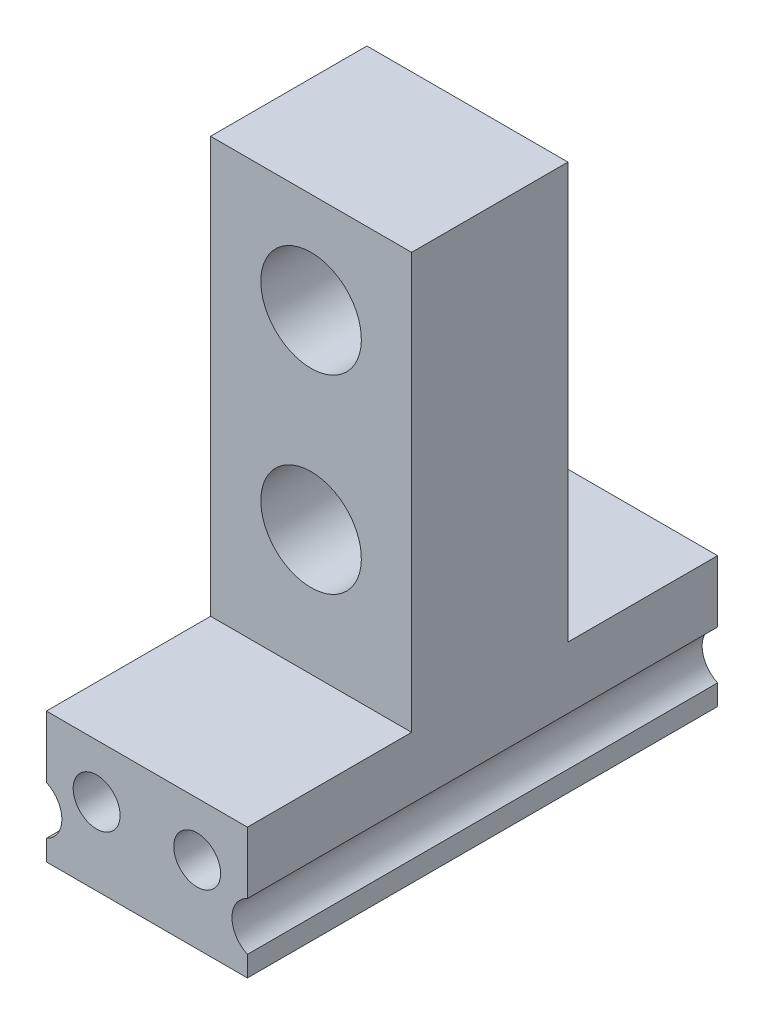
ISO-10303-21;
HEADER;
FILE_DESCRIPTION(('STEP AP214'),'2;1');
FILE_NAME('part.step','',(''),(''),'','','');
FILE_SCHEMA(('AUTOMOTIVE_DESIGN { 1 0 10303 214 1 1 1 1 }'));
ENDSEC;
DATA;
#1=APPLICATION_CONTEXT('core data for automotive mechanical design processes');
#2=APPLICATION_PROTOCOL_DEFINITION('international standard','automotive_design',2000,#1);
#3=PRODUCT_CONTEXT('',#1,'mechanical');
#4=PRODUCT('Part','Part','',(#3));
#5=PRODUCT_RELATED_PRODUCT_CATEGORY('part','',(#4));
#6=PRODUCT_DEFINITION_FORMATION('','',#4);
#7=PRODUCT_DEFINITION_CONTEXT('part definition',#1,'design');
#8=PRODUCT_DEFINITION('design','',#6,#7);
#9=PRODUCT_DEFINITION_SHAPE('','',#8);
#10=(LENGTH_UNIT() NAMED_UNIT(*) SI_UNIT(.MILLI.,.METRE.));
#11=(NAMED_UNIT(*) PLANE_ANGLE_UNIT() SI_UNIT($,.RADIAN.));
#12=(NAMED_UNIT(*) SI_UNIT($,.STERADIAN.) SOLID_ANGLE_UNIT());
#13=UNCERTAINTY_MEASURE_WITH_UNIT(LENGTH_MEASURE(1.E-05),#10,'distance_accuracy_value','');
#14=(GEOMETRIC_REPRESENTATION_CONTEXT(3) GLOBAL_UNCERTAINTY_ASSIGNED_CONTEXT((#13)) GLOBAL_UNIT_ASSIGNED_CONTEXT((#10,
#11,#12)) REPRESENTATION_CONTEXT('',''));
#15=CARTESIAN_POINT('',(0.,0.,0.));
#16=DIRECTION('',(0.,0.,1.));
#17=DIRECTION('',(1.,0.,0.));
#18=AXIS2_PLACEMENT_3D('',#15,#16,#17);
#19=CARTESIAN_POINT('',(415.099665512143,0.,42.1));
#20=DIRECTION('',(1.,0.,0.));
#21=DIRECTION('',(0.,0.,-1.));
#22=AXIS2_PLACEMENT_3D('',#19,#20,#21);
#23=PLANE('',#22);
#24=DIRECTION('',(0.,0.,-1.));
#25=VECTOR('',#24,1.);
#26=CARTESIAN_POINT('',(415.099665512143,758.893186936948,42.1));
#27=LINE('',#26,#25);
#28=CARTESIAN_POINT('',(415.099665512143,758.893186936948,42.1));
#29=VERTEX_POINT('',#28);
#30=CARTESIAN_POINT('',(415.099665512143,758.893186936948,27.4));
#31=VERTEX_POINT('',#30);
#32=EDGE_CURVE('E62',#29,#31,#27,.T.);
#33=ORIENTED_EDGE('',*,*,#32,.T.);
#34=DIRECTION('',(0.,1.,0.));
#35=VECTOR('',#34,1.);
#36=CARTESIAN_POINT('',(415.099665512143,0.,27.3999999999999));
#37=LINE('',#36,#35);
#38=CARTESIAN_POINT('',(415.099665512143,796.113186936948,27.4));
#39=VERTEX_POINT('',#38);
#40=EDGE_CURVE('E177',#31,#39,#37,.T.);
#41=ORIENTED_EDGE('',*,*,#40,.T.);
#42=DIRECTION('',(0.,0.,-1.));
#43=VECTOR('',#42,1.);
#44=CARTESIAN_POINT('',(415.099665512143,796.113186936948,42.1));
#45=LINE('',#44,#43);
#46=CARTESIAN_POINT('',(415.099665512143,796.113186936948,13.4));
#47=VERTEX_POINT('',#46);
#48=EDGE_CURVE('E172',#39,#47,#45,.T.);
#49=ORIENTED_EDGE('',*,*,#48,.T.);
#50=DIRECTION('',(0.,-1.,0.));
#51=VECTOR('',#50,1.);
#52=CARTESIAN_POINT('',(415.099665512143,0.,13.3999999999999));
#53=LINE('',#52,#51);
#54=CARTESIAN_POINT('',(415.099665512143,758.893186936948,13.4));
#55=VERTEX_POINT('',#54);
#56=EDGE_CURVE('E245',#47,#55,#53,.T.);
#57=ORIENTED_EDGE('',*,*,#56,.T.);
#58=DIRECTION('',(0.,0.,-1.));
#59=VECTOR('',#58,1.);
#60=CARTESIAN_POINT('',(415.099665512143,758.893186936948,42.1));
#61=LINE('',#60,#59);
#62=CARTESIAN_POINT('',(415.099665512143,758.893186936948,0.));
#63=VERTEX_POINT('',#62);
#64=EDGE_CURVE('E247',#55,#63,#61,.T.);
#65=ORIENTED_EDGE('',*,*,#64,.T.);
#66=DIRECTION('',(0.,-1.,0.));
#67=VECTOR('',#66,1.);
#68=CARTESIAN_POINT('',(415.099665512143,0.,0.));
#69=LINE('',#68,#67);
#70=CARTESIAN_POINT('',(415.099665512143,753.358417871514,0.));
#71=VERTEX_POINT('',#70);
#72=EDGE_CURVE('E173',#63,#71,#69,.T.);
#73=ORIENTED_EDGE('',*,*,#72,.T.);
#74=DIRECTION('',(0.,0.,-1.));
#75=VECTOR('',#74,1.);
#76=CARTESIAN_POINT('',(415.099665512143,753.358417871514,42.1));
#77=LINE('',#76,#75);
#78=CARTESIAN_POINT('',(415.099665512143,753.358417871514,42.1));
#79=VERTEX_POINT('',#78);
#80=EDGE_CURVE('E231',#79,#71,#77,.T.);
#81=ORIENTED_EDGE('',*,*,#80,.F.);
#82=DIRECTION('',(0.,-1.,0.));
#83=VECTOR('',#82,1.);
#84=CARTESIAN_POINT('',(415.099665512143,0.,42.1));
#85=LINE('',#84,#83);
#86=EDGE_CURVE('E206',#29,#79,#85,.T.);
#87=ORIENTED_EDGE('',*,*,#86,.F.);
#88=EDGE_LOOP('',(#33,#41,#49,#57,#65,#73,#81,#87));
#89=FACE_BOUND('',#88,.T.);
#90=ADVANCED_FACE('F45',(#89),#23,.F.);
#91=CARTESIAN_POINT('',(414.099665512143,751.193186936948,42.1));
#92=DIRECTION('',(0.,0.,-1.));
#93=DIRECTION('',(-1.,0.,0.));
#94=AXIS2_PLACEMENT_3D('',#91,#92,#93);
#95=CYLINDRICAL_SURFACE('',#94,2.38500000000002);
#96=CARTESIAN_POINT('',(414.099665512143,751.193186936948,0.));
#97=DIRECTION('',(0.,0.,1.));
#98=DIRECTION('',(1.,0.,0.));
#99=AXIS2_PLACEMENT_3D('',#96,#97,#98);
#100=CIRCLE('',#99,2.38500000000002);
#101=CARTESIAN_POINT('',(415.099665512143,749.027956002383,0.));
#102=VERTEX_POINT('',#101);
#103=EDGE_CURVE('E176',#102,#71,#100,.T.);
#104=ORIENTED_EDGE('',*,*,#103,.F.);
#105=DIRECTION('',(0.,0.,-1.));
#106=VECTOR('',#105,1.);
#107=CARTESIAN_POINT('',(415.099665512143,749.027956002383,42.1));
#108=LINE('',#107,#106);
#109=CARTESIAN_POINT('',(415.099665512143,749.027956002383,42.1));
#110=VERTEX_POINT('',#109);
#111=EDGE_CURVE('E228',#110,#102,#108,.T.);
#112=ORIENTED_EDGE('',*,*,#111,.F.);
#113=CARTESIAN_POINT('',(414.099665512143,751.193186936948,42.1));
#114=DIRECTION('',(0.,0.,1.));
#115=DIRECTION('',(1.,0.,0.));
#116=AXIS2_PLACEMENT_3D('',#113,#114,#115);
#117=CIRCLE('',#116,2.38500000000002);
#118=EDGE_CURVE('E268',#110,#79,#117,.T.);
#119=ORIENTED_EDGE('',*,*,#118,.T.);
#120=ORIENTED_EDGE('',*,*,#80,.T.);
#121=EDGE_LOOP('',(#104,#112,#119,#120));
#122=FACE_BOUND('',#121,.T.);
#123=ADVANCED_FACE('F334',(#122),#95,.F.);
#124=CARTESIAN_POINT('',(415.099665512143,0.,42.1));
#125=DIRECTION('',(1.,0.,0.));
#126=DIRECTION('',(0.,0.,-1.));
#127=AXIS2_PLACEMENT_3D('',#124,#125,#126);
#128=PLANE('',#127);
#129=DIRECTION('',(0.,-1.,0.));
#130=VECTOR('',#129,1.);
#131=CARTESIAN_POINT('',(415.099665512143,0.,0.));
#132=LINE('',#131,#130);
#133=CARTESIAN_POINT('',(415.099665512143,747.193186936948,0.));
#134=VERTEX_POINT('',#133);
#135=EDGE_CURVE('E181',#102,#134,#132,.T.);
#136=ORIENTED_EDGE('',*,*,#135,.T.);
#137=DIRECTION('',(0.,0.,-1.));
#138=VECTOR('',#137,1.);
#139=CARTESIAN_POINT('',(415.099665512143,747.193186936948,42.1));
#140=LINE('',#139,#138);
#141=CARTESIAN_POINT('',(415.099665512143,747.193186936948,42.1));
#142=VERTEX_POINT('',#141);
#143=EDGE_CURVE('E224',#142,#134,#140,.T.);
#144=ORIENTED_EDGE('',*,*,#143,.F.);
#145=DIRECTION('',(0.,-1.,0.));
#146=VECTOR('',#145,1.);
#147=CARTESIAN_POINT('',(415.099665512143,0.,42.1));
#148=LINE('',#147,#146);
#149=EDGE_CURVE('E272',#110,#142,#148,.T.);
#150=ORIENTED_EDGE('',*,*,#149,.F.);
#151=ORIENTED_EDGE('',*,*,#111,.T.);
#152=EDGE_LOOP('',(#136,#144,#150,#151));
#153=FACE_BOUND('',#152,.T.);
#154=ADVANCED_FACE('F339',(#153),#128,.F.);
#155=CARTESIAN_POINT('',(0.,747.193186936948,42.1));
#156=DIRECTION('',(0.,1.,0.));
#157=DIRECTION('',(0.,0.,1.));
#158=AXIS2_PLACEMENT_3D('',#155,#156,#157);
#159=PLANE('',#158);
#160=DIRECTION('',(1.,0.,0.));
#161=VECTOR('',#160,1.);
#162=CARTESIAN_POINT('',(0.,747.193186936948,0.));
#163=LINE('',#162,#161);
#164=CARTESIAN_POINT('',(433.099665512143,747.193186936948,0.));
#165=VERTEX_POINT('',#164);
#166=EDGE_CURVE('E184',#134,#165,#163,.T.);
#167=ORIENTED_EDGE('',*,*,#166,.T.);
#168=DIRECTION('',(0.,0.,-1.));
#169=VECTOR('',#168,1.);
#170=CARTESIAN_POINT('',(433.099665512143,747.193186936948,42.1));
#171=LINE('',#170,#169);
#172=CARTESIAN_POINT('',(433.099665512143,747.193186936948,42.1));
#173=VERTEX_POINT('',#172);
#174=EDGE_CURVE('E220',#173,#165,#171,.T.);
#175=ORIENTED_EDGE('',*,*,#174,.F.);
#176=DIRECTION('',(1.,0.,0.));
#177=VECTOR('',#176,1.);
#178=CARTESIAN_POINT('',(0.,747.193186936948,42.1));
#179=LINE('',#178,#177);
#180=EDGE_CURVE('E275',#142,#173,#179,.T.);
#181=ORIENTED_EDGE('',*,*,#180,.F.);
#182=ORIENTED_EDGE('',*,*,#143,.T.);
#183=EDGE_LOOP('',(#167,#175,#181,#182));
#184=FACE_BOUND('',#183,.T.);
#185=ADVANCED_FACE('F379',(#184),#159,.F.);
#186=CARTESIAN_POINT('',(433.099665512143,0.,42.1));
#187=DIRECTION('',(-1.,0.,0.));
#188=DIRECTION('',(0.,0.,1.));
#189=AXIS2_PLACEMENT_3D('',#186,#187,#188);
#190=PLANE('',#189);
#191=DIRECTION('',(0.,1.,0.));
#192=VECTOR('',#191,1.);
#193=CARTESIAN_POINT('',(433.099665512143,0.,0.));
#194=LINE('',#193,#192);
#195=CARTESIAN_POINT('',(433.099665512143,749.027956002383,0.));
#196=VERTEX_POINT('',#195);
#197=EDGE_CURVE('E187',#165,#196,#194,.T.);
#198=ORIENTED_EDGE('',*,*,#197,.T.);
#199=DIRECTION('',(0.,0.,-1.));
#200=VECTOR('',#199,1.);
#201=CARTESIAN_POINT('',(433.099665512143,749.027956002383,42.1));
#202=LINE('',#201,#200);
#203=CARTESIAN_POINT('',(433.099665512143,749.027956002383,42.1));
#204=VERTEX_POINT('',#203);
#205=EDGE_CURVE('E217',#204,#196,#202,.T.);
#206=ORIENTED_EDGE('',*,*,#205,.F.);
#207=DIRECTION('',(0.,1.,0.));
#208=VECTOR('',#207,1.);
#209=CARTESIAN_POINT('',(433.099665512143,0.,42.1));
#210=LINE('',#209,#208);
#211=EDGE_CURVE('E165',#173,#204,#210,.T.);
#212=ORIENTED_EDGE('',*,*,#211,.F.);
#213=ORIENTED_EDGE('',*,*,#174,.T.);
#214=EDGE_LOOP('',(#198,#206,#212,#213));
#215=FACE_BOUND('',#214,.T.);
#216=ADVANCED_FACE('F283',(#215),#190,.F.);
#217=CARTESIAN_POINT('',(434.099665512143,751.193186936949,42.1));
#218=DIRECTION('',(0.,0.,-1.));
#219=DIRECTION('',(-1.,0.,0.));
#220=AXIS2_PLACEMENT_3D('',#217,#218,#219);
#221=CYLINDRICAL_SURFACE('',#220,2.38499999999994);
#222=CARTESIAN_POINT('',(434.099665512143,751.193186936949,0.));
#223=DIRECTION('',(0.,0.,1.));
#224=DIRECTION('',(1.,0.,0.));
#225=AXIS2_PLACEMENT_3D('',#222,#223,#224);
#226=CIRCLE('',#225,2.38499999999994);
#227=CARTESIAN_POINT('',(433.099665512143,753.358417871515,0.));
#228=VERTEX_POINT('',#227);
#229=EDGE_CURVE('E191',#228,#196,#226,.T.);
#230=ORIENTED_EDGE('',*,*,#229,.F.);
#231=DIRECTION('',(0.,0.,-1.));
#232=VECTOR('',#231,1.);
#233=CARTESIAN_POINT('',(433.099665512143,753.358417871515,42.1));
#234=LINE('',#233,#232);
#235=CARTESIAN_POINT('',(433.099665512143,753.358417871515,42.1));
#236=VERTEX_POINT('',#235);
#237=EDGE_CURVE('E214',#236,#228,#234,.T.);
#238=ORIENTED_EDGE('',*,*,#237,.F.);
#239=CARTESIAN_POINT('',(434.099665512143,751.193186936949,42.1));
#240=DIRECTION('',(0.,0.,1.));
#241=DIRECTION('',(1.,0.,0.));
#242=AXIS2_PLACEMENT_3D('',#239,#240,#241);
#243=CIRCLE('',#242,2.38499999999994);
#244=EDGE_CURVE('E156',#236,#204,#243,.T.);
#245=ORIENTED_EDGE('',*,*,#244,.T.);
#246=ORIENTED_EDGE('',*,*,#205,.T.);
#247=EDGE_LOOP('',(#230,#238,#245,#246));
#248=FACE_BOUND('',#247,.T.);
#249=ADVANCED_FACE('F287',(#248),#221,.F.);
#250=CARTESIAN_POINT('',(433.099665512143,0.,42.1));
#251=DIRECTION('',(1.,0.,0.));
#252=DIRECTION('',(0.,0.,-1.));
#253=AXIS2_PLACEMENT_3D('',#250,#251,#252);
#254=PLANE('',#253);
#255=DIRECTION('',(0.,1.,0.));
#256=VECTOR('',#255,1.);
#257=CARTESIAN_POINT('',(433.099665512143,796.113186936948,27.4));
#258=LINE('',#257,#256);
#259=CARTESIAN_POINT('',(433.099665512143,758.893186936948,27.4));
#260=VERTEX_POINT('',#259);
#261=CARTESIAN_POINT('',(433.099665512143,796.113186936948,27.4));
#262=VERTEX_POINT('',#261);
#263=EDGE_CURVE('E148',#260,#262,#258,.T.);
#264=ORIENTED_EDGE('',*,*,#263,.F.);
#265=DIRECTION('',(0.,0.,-1.));
#266=VECTOR('',#265,1.);
#267=CARTESIAN_POINT('',(433.099665512143,758.893186936948,42.1));
#268=LINE('',#267,#266);
#269=CARTESIAN_POINT('',(433.099665512143,758.893186936948,42.1));
#270=VERTEX_POINT('',#269);
#271=EDGE_CURVE('E137',#270,#260,#268,.T.);
#272=ORIENTED_EDGE('',*,*,#271,.F.);
#273=DIRECTION('',(0.,-1.,0.));
#274=VECTOR('',#273,1.);
#275=CARTESIAN_POINT('',(433.099665512143,0.,42.1));
#276=LINE('',#275,#274);
#277=EDGE_CURVE('E145',#270,#236,#276,.T.);
#278=ORIENTED_EDGE('',*,*,#277,.T.);
#279=ORIENTED_EDGE('',*,*,#237,.T.);
#280=DIRECTION('',(0.,-1.,0.));
#281=VECTOR('',#280,1.);
#282=CARTESIAN_POINT('',(433.099665512143,0.,0.));
#283=LINE('',#282,#281);
#284=CARTESIAN_POINT('',(433.099665512143,758.893186936948,0.));
#285=VERTEX_POINT('',#284);
#286=EDGE_CURVE('E195',#285,#228,#283,.T.);
#287=ORIENTED_EDGE('',*,*,#286,.F.);
#288=DIRECTION('',(0.,0.,-1.));
#289=VECTOR('',#288,1.);
#290=CARTESIAN_POINT('',(433.099665512143,758.893186936948,13.4));
#291=LINE('',#290,#289);
#292=CARTESIAN_POINT('',(433.099665512143,758.893186936948,13.4));
#293=VERTEX_POINT('',#292);
#294=EDGE_CURVE('E70',#293,#285,#291,.T.);
#295=ORIENTED_EDGE('',*,*,#294,.F.);
#296=DIRECTION('',(0.,-1.,0.));
#297=VECTOR('',#296,1.);
#298=CARTESIAN_POINT('',(433.099665512143,796.113186936948,13.4));
#299=LINE('',#298,#297);
#300=CARTESIAN_POINT('',(433.099665512143,796.113186936948,13.4));
#301=VERTEX_POINT('',#300);
#302=EDGE_CURVE('E150',#301,#293,#299,.T.);
#303=ORIENTED_EDGE('',*,*,#302,.F.);
#304=DIRECTION('',(0.,0.,-1.));
#305=VECTOR('',#304,1.);
#306=CARTESIAN_POINT('',(433.099665512143,796.113186936948,42.1));
#307=LINE('',#306,#305);
#308=EDGE_CURVE('E210',#262,#301,#307,.T.);
#309=ORIENTED_EDGE('',*,*,#308,.F.);
#310=EDGE_LOOP('',(#264,#272,#278,#279,#287,#295,#303,#309));
#311=FACE_BOUND('',#310,.T.);
#312=ADVANCED_FACE('F143',(#311),#254,.T.);
#313=CARTESIAN_POINT('',(428.599665512143,754.093186936949,42.1));
#314=DIRECTION('',(0.,0.,-1.));
#315=DIRECTION('',(-1.,0.,0.));
#316=AXIS2_PLACEMENT_3D('',#313,#314,#315);
#317=CYLINDRICAL_SURFACE('',#316,2.09999999999999);
#318=CARTESIAN_POINT('',(428.599665512143,754.093186936949,42.1));
#319=DIRECTION('',(0.,0.,1.));
#320=DIRECTION('',(1.,0.,0.));
#321=AXIS2_PLACEMENT_3D('',#318,#319,#320);
#322=CIRCLE('',#321,2.09999999999999);
#323=CARTESIAN_POINT('',(430.699665512143,754.093186936949,42.1));
#324=VERTEX_POINT('',#323);
#325=EDGE_CURVE('E158',#324,#324,#322,.T.);
#326=ORIENTED_EDGE('',*,*,#325,.T.);
#327=EDGE_LOOP('',(#326));
#328=FACE_BOUND('',#327,.T.);
#329=CARTESIAN_POINT('',(428.599665512143,754.093186936949,0.));
#330=DIRECTION('',(0.,0.,1.));
#331=DIRECTION('',(1.,0.,0.));
#332=AXIS2_PLACEMENT_3D('',#329,#330,#331);
#333=CIRCLE('',#332,2.09999999999999);
#334=CARTESIAN_POINT('',(430.699665512143,754.093186936949,0.));
#335=VERTEX_POINT('',#334);
#336=EDGE_CURVE('E198',#335,#335,#333,.T.);
#337=ORIENTED_EDGE('',*,*,#336,.F.);
#338=EDGE_LOOP('',(#337));
#339=FACE_BOUND('',#338,.T.);
#340=ADVANCED_FACE('F367',(#328,#339),#317,.F.);
#341=CARTESIAN_POINT('',(0.,796.113186936948,42.1));
#342=DIRECTION('',(0.,1.,0.));
#343=DIRECTION('',(0.,0.,1.));
#344=AXIS2_PLACEMENT_3D('',#341,#342,#343);
#345=PLANE('',#344);
#346=DIRECTION('',(1.,0.,0.));
#347=VECTOR('',#346,1.);
#348=CARTESIAN_POINT('',(390.999665512143,796.113186936948,27.4));
#349=LINE('',#348,#347);
#350=EDGE_CURVE('E253',#39,#262,#349,.T.);
#351=ORIENTED_EDGE('',*,*,#350,.T.);
#352=ORIENTED_EDGE('',*,*,#308,.T.);
#353=DIRECTION('',(1.,0.,0.));
#354=VECTOR('',#353,1.);
#355=CARTESIAN_POINT('',(390.999665512143,796.113186936948,13.4));
#356=LINE('',#355,#354);
#357=EDGE_CURVE('E302',#47,#301,#356,.T.);
#358=ORIENTED_EDGE('',*,*,#357,.F.);
#359=ORIENTED_EDGE('',*,*,#48,.F.);
#360=EDGE_LOOP('',(#351,#352,#358,#359));
#361=FACE_BOUND('',#360,.T.);
#362=ADVANCED_FACE('F306',(#361),#345,.T.);
#363=CARTESIAN_POINT('',(419.599665512143,754.093186936949,42.1));
#364=DIRECTION('',(0.,0.,-1.));
#365=DIRECTION('',(-1.,0.,0.));
#366=AXIS2_PLACEMENT_3D('',#363,#364,#365);
#367=CYLINDRICAL_SURFACE('',#366,2.09999999999999);
#368=CARTESIAN_POINT('',(419.599665512143,754.093186936949,42.1));
#369=DIRECTION('',(0.,0.,1.));
#370=DIRECTION('',(1.,0.,0.));
#371=AXIS2_PLACEMENT_3D('',#368,#369,#370);
#372=CIRCLE('',#371,2.09999999999999);
#373=CARTESIAN_POINT('',(421.699665512143,754.093186936949,42.1));
#374=VERTEX_POINT('',#373);
#375=EDGE_CURVE('E163',#374,#374,#372,.T.);
#376=ORIENTED_EDGE('',*,*,#375,.T.);
#377=EDGE_LOOP('',(#376));
#378=FACE_BOUND('',#377,.T.);
#379=CARTESIAN_POINT('',(419.599665512143,754.093186936949,0.));
#380=DIRECTION('',(0.,0.,1.));
#381=DIRECTION('',(1.,0.,0.));
#382=AXIS2_PLACEMENT_3D('',#379,#380,#381);
#383=CIRCLE('',#382,2.09999999999999);
#384=CARTESIAN_POINT('',(421.699665512143,754.093186936949,0.));
#385=VERTEX_POINT('',#384);
#386=EDGE_CURVE('E202',#385,#385,#383,.T.);
#387=ORIENTED_EDGE('',*,*,#386,.F.);
#388=EDGE_LOOP('',(#387));
#389=FACE_BOUND('',#388,.T.);
#390=ADVANCED_FACE('F362',(#378,#389),#367,.F.);
#391=CARTESIAN_POINT('',(0.,0.,42.1));
#392=DIRECTION('',(0.,0.,1.));
#393=DIRECTION('',(1.,0.,0.));
#394=AXIS2_PLACEMENT_3D('',#391,#392,#393);
#395=PLANE('',#394);
#396=DIRECTION('',(1.,0.,0.));
#397=VECTOR('',#396,1.);
#398=CARTESIAN_POINT('',(0.,758.893186936948,42.1));
#399=LINE('',#398,#397);
#400=EDGE_CURVE('E11',#29,#270,#399,.T.);
#401=ORIENTED_EDGE('',*,*,#400,.F.);
#402=ORIENTED_EDGE('',*,*,#86,.T.);
#403=ORIENTED_EDGE('',*,*,#118,.F.);
#404=ORIENTED_EDGE('',*,*,#149,.T.);
#405=ORIENTED_EDGE('',*,*,#180,.T.);
#406=ORIENTED_EDGE('',*,*,#211,.T.);
#407=ORIENTED_EDGE('',*,*,#244,.F.);
#408=ORIENTED_EDGE('',*,*,#277,.F.);
#409=EDGE_LOOP('',(#401,#402,#403,#404,#405,#406,#407,#408));
#410=FACE_BOUND('',#409,.T.);
#411=ORIENTED_EDGE('',*,*,#325,.F.);
#412=EDGE_LOOP('',(#411));
#413=FACE_BOUND('',#412,.T.);
#414=ORIENTED_EDGE('',*,*,#375,.F.);
#415=EDGE_LOOP('',(#414));
#416=FACE_BOUND('',#415,.T.);
#417=ADVANCED_FACE('F153',(#410,#413,#416),#395,.T.);
#418=CARTESIAN_POINT('',(0.,0.,0.));
#419=DIRECTION('',(0.,0.,1.));
#420=DIRECTION('',(1.,0.,0.));
#421=AXIS2_PLACEMENT_3D('',#418,#419,#420);
#422=PLANE('',#421);
#423=ORIENTED_EDGE('',*,*,#72,.F.);
#424=DIRECTION('',(1.,0.,0.));
#425=VECTOR('',#424,1.);
#426=CARTESIAN_POINT('',(0.,758.893186936948,0.));
#427=LINE('',#426,#425);
#428=EDGE_CURVE('E55',#63,#285,#427,.T.);
#429=ORIENTED_EDGE('',*,*,#428,.T.);
#430=ORIENTED_EDGE('',*,*,#286,.T.);
#431=ORIENTED_EDGE('',*,*,#229,.T.);
#432=ORIENTED_EDGE('',*,*,#197,.F.);
#433=ORIENTED_EDGE('',*,*,#166,.F.);
#434=ORIENTED_EDGE('',*,*,#135,.F.);
#435=ORIENTED_EDGE('',*,*,#103,.T.);
#436=EDGE_LOOP('',(#423,#429,#430,#431,#432,#433,#434,#435));
#437=FACE_BOUND('',#436,.T.);
#438=ORIENTED_EDGE('',*,*,#336,.T.);
#439=EDGE_LOOP('',(#438));
#440=FACE_BOUND('',#439,.T.);
#441=ORIENTED_EDGE('',*,*,#386,.T.);
#442=EDGE_LOOP('',(#441));
#443=FACE_BOUND('',#442,.T.);
#444=ADVANCED_FACE('F292',(#437,#440,#443),#422,.F.);
#445=CARTESIAN_POINT('',(390.999665512143,796.113186936948,13.4));
#446=DIRECTION('',(0.,0.,1.));
#447=DIRECTION('',(0.,-1.,0.));
#448=AXIS2_PLACEMENT_3D('',#445,#446,#447);
#449=PLANE('',#448);
#450=CARTESIAN_POINT('',(424.099665512143,787.113186936948,13.4));
#451=DIRECTION('',(0.,0.,1.));
#452=DIRECTION('',(0.,-1.,0.));
#453=AXIS2_PLACEMENT_3D('',#450,#451,#452);
#454=CIRCLE('',#453,4.5);
#455=CARTESIAN_POINT('',(424.099665512143,782.613186936948,13.4));
#456=VERTEX_POINT('',#455);
#457=EDGE_CURVE('E239',#456,#456,#454,.T.);
#458=ORIENTED_EDGE('',*,*,#457,.T.);
#459=EDGE_LOOP('',(#458));
#460=FACE_BOUND('',#459,.T.);
#461=CARTESIAN_POINT('',(424.099665512143,770.113186936948,13.4));
#462=DIRECTION('',(0.,0.,1.));
#463=DIRECTION('',(0.,-1.,0.));
#464=AXIS2_PLACEMENT_3D('',#461,#462,#463);
#465=CIRCLE('',#464,4.5);
#466=CARTESIAN_POINT('',(424.099665512143,765.613186936948,13.4));
#467=VERTEX_POINT('',#466);
#468=EDGE_CURVE('E236',#467,#467,#465,.T.);
#469=ORIENTED_EDGE('',*,*,#468,.T.);
#470=EDGE_LOOP('',(#469));
#471=FACE_BOUND('',#470,.T.);
#472=ORIENTED_EDGE('',*,*,#357,.T.);
#473=ORIENTED_EDGE('',*,*,#302,.T.);
#474=DIRECTION('',(1.,0.,0.));
#475=VECTOR('',#474,1.);
#476=CARTESIAN_POINT('',(390.999665512143,758.893186936948,13.4));
#477=LINE('',#476,#475);
#478=EDGE_CURVE('E303',#55,#293,#477,.T.);
#479=ORIENTED_EDGE('',*,*,#478,.F.);
#480=ORIENTED_EDGE('',*,*,#56,.F.);
#481=EDGE_LOOP('',(#472,#473,#479,#480));
#482=FACE_BOUND('',#481,.T.);
#483=ADVANCED_FACE('F300',(#460,#471,#482),#449,.F.);
#484=CARTESIAN_POINT('',(390.999665512143,758.893186936948,13.4));
#485=DIRECTION('',(0.,-1.,0.));
#486=DIRECTION('',(0.,0.,-1.));
#487=AXIS2_PLACEMENT_3D('',#484,#485,#486);
#488=PLANE('',#487);
#489=ORIENTED_EDGE('',*,*,#478,.T.);
#490=ORIENTED_EDGE('',*,*,#294,.T.);
#491=ORIENTED_EDGE('',*,*,#428,.F.);
#492=ORIENTED_EDGE('',*,*,#64,.F.);
#493=EDGE_LOOP('',(#489,#490,#491,#492));
#494=FACE_BOUND('',#493,.T.);
#495=ADVANCED_FACE('F294',(#494),#488,.F.);
#496=CARTESIAN_POINT('',(390.999665512143,796.113186936948,27.4));
#497=DIRECTION('',(0.,0.,-1.));
#498=DIRECTION('',(0.,1.,0.));
#499=AXIS2_PLACEMENT_3D('',#496,#497,#498);
#500=PLANE('',#499);
#501=CARTESIAN_POINT('',(424.099665512143,787.113186936948,27.4));
#502=DIRECTION('',(0.,0.,-1.));
#503=DIRECTION('',(0.,1.,0.));
#504=AXIS2_PLACEMENT_3D('',#501,#502,#503);
#505=CIRCLE('',#504,4.5);
#506=CARTESIAN_POINT('',(424.099665512143,791.613186936949,27.4));
#507=VERTEX_POINT('',#506);
#508=EDGE_CURVE('E260',#507,#507,#505,.T.);
#509=ORIENTED_EDGE('',*,*,#508,.T.);
#510=EDGE_LOOP('',(#509));
#511=FACE_BOUND('',#510,.T.);
#512=CARTESIAN_POINT('',(424.099665512143,770.113186936948,27.4));
#513=DIRECTION('',(0.,0.,-1.));
#514=DIRECTION('',(0.,1.,0.));
#515=AXIS2_PLACEMENT_3D('',#512,#513,#514);
#516=CIRCLE('',#515,4.5);
#517=CARTESIAN_POINT('',(424.099665512143,774.613186936948,27.4));
#518=VERTEX_POINT('',#517);
#519=EDGE_CURVE('E49',#518,#518,#516,.T.);
#520=ORIENTED_EDGE('',*,*,#519,.T.);
#521=EDGE_LOOP('',(#520));
#522=FACE_BOUND('',#521,.T.);
#523=DIRECTION('',(1.,0.,0.));
#524=VECTOR('',#523,1.);
#525=CARTESIAN_POINT('',(390.999665512143,758.893186936948,27.4));
#526=LINE('',#525,#524);
#527=EDGE_CURVE('E317',#31,#260,#526,.T.);
#528=ORIENTED_EDGE('',*,*,#527,.T.);
#529=ORIENTED_EDGE('',*,*,#263,.T.);
#530=ORIENTED_EDGE('',*,*,#350,.F.);
#531=ORIENTED_EDGE('',*,*,#40,.F.);
#532=EDGE_LOOP('',(#528,#529,#530,#531));
#533=FACE_BOUND('',#532,.T.);
#534=ADVANCED_FACE('F322',(#511,#522,#533),#500,.F.);
#535=CARTESIAN_POINT('',(390.999665512143,758.893186936948,42.1));
#536=DIRECTION('',(0.,-1.,0.));
#537=DIRECTION('',(0.,0.,-1.));
#538=AXIS2_PLACEMENT_3D('',#535,#536,#537);
#539=PLANE('',#538);
#540=ORIENTED_EDGE('',*,*,#400,.T.);
#541=ORIENTED_EDGE('',*,*,#271,.T.);
#542=ORIENTED_EDGE('',*,*,#527,.F.);
#543=ORIENTED_EDGE('',*,*,#32,.F.);
#544=EDGE_LOOP('',(#540,#541,#542,#543));
#545=FACE_BOUND('',#544,.T.);
#546=ADVANCED_FACE('F136',(#545),#539,.F.);
#547=CARTESIAN_POINT('',(424.099665512143,770.113186936948,42.1));
#548=DIRECTION('',(0.,0.,-1.));
#549=DIRECTION('',(-1.,0.,0.));
#550=AXIS2_PLACEMENT_3D('',#547,#548,#549);
#551=CYLINDRICAL_SURFACE('',#550,4.5);
#552=ORIENTED_EDGE('',*,*,#519,.F.);
#553=EDGE_LOOP('',(#552));
#554=FACE_BOUND('',#553,.T.);
#555=ORIENTED_EDGE('',*,*,#468,.F.);
#556=EDGE_LOOP('',(#555));
#557=FACE_BOUND('',#556,.T.);
#558=ADVANCED_FACE('F47',(#554,#557),#551,.F.);
#559=CARTESIAN_POINT('',(424.099665512143,787.113186936948,42.1));
#560=DIRECTION('',(0.,0.,-1.));
#561=DIRECTION('',(-1.,0.,0.));
#562=AXIS2_PLACEMENT_3D('',#559,#560,#561);
#563=CYLINDRICAL_SURFACE('',#562,4.5);
#564=ORIENTED_EDGE('',*,*,#508,.F.);
#565=EDGE_LOOP('',(#564));
#566=FACE_BOUND('',#565,.T.);
#567=ORIENTED_EDGE('',*,*,#457,.F.);
#568=EDGE_LOOP('',(#567));
#569=FACE_BOUND('',#568,.T.);
#570=ADVANCED_FACE('F343',(#566,#569),#563,.F.);
#571=CLOSED_SHELL('',(#90,#123,#154,#185,#216,#249,#312,#340,#362,#390,#417,#444,#483,#495,#534,
#546,#558,#570));
#572=MANIFOLD_SOLID_BREP('B2',#571);
#573=ADVANCED_BREP_SHAPE_REPRESENTATION('',(#18,#572),#14);
#574=SHAPE_DEFINITION_REPRESENTATION(#9,#573);
ENDSEC;
END-ISO-10303-21;
